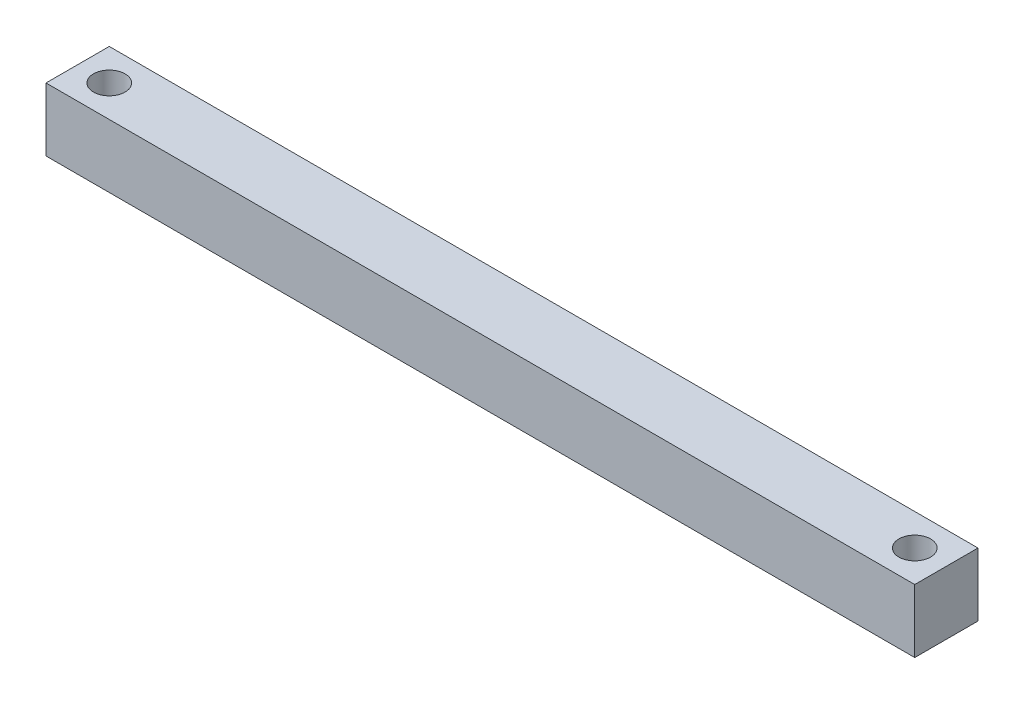
ISO-10303-21;
HEADER;
FILE_DESCRIPTION(('STEP AP214'),'2;1');
FILE_NAME('part.step','',(''),(''),'','','');
FILE_SCHEMA(('AUTOMOTIVE_DESIGN { 1 0 10303 214 1 1 1 1 }'));
ENDSEC;
DATA;
#1=APPLICATION_CONTEXT('core data for automotive mechanical design processes');
#2=APPLICATION_PROTOCOL_DEFINITION('international standard','automotive_design',2000,#1);
#3=PRODUCT_CONTEXT('',#1,'mechanical');
#4=PRODUCT('Part','Part','',(#3));
#5=PRODUCT_RELATED_PRODUCT_CATEGORY('part','',(#4));
#6=PRODUCT_DEFINITION_FORMATION('','',#4);
#7=PRODUCT_DEFINITION_CONTEXT('part definition',#1,'design');
#8=PRODUCT_DEFINITION('design','',#6,#7);
#9=PRODUCT_DEFINITION_SHAPE('','',#8);
#10=(LENGTH_UNIT() NAMED_UNIT(*) SI_UNIT(.MILLI.,.METRE.));
#11=(NAMED_UNIT(*) PLANE_ANGLE_UNIT() SI_UNIT($,.RADIAN.));
#12=(NAMED_UNIT(*) SI_UNIT($,.STERADIAN.) SOLID_ANGLE_UNIT());
#13=UNCERTAINTY_MEASURE_WITH_UNIT(LENGTH_MEASURE(1.E-05),#10,'distance_accuracy_value','');
#14=(GEOMETRIC_REPRESENTATION_CONTEXT(3) GLOBAL_UNCERTAINTY_ASSIGNED_CONTEXT((#13)) GLOBAL_UNIT_ASSIGNED_CONTEXT((#10,
#11,#12)) REPRESENTATION_CONTEXT('',''));
#15=CARTESIAN_POINT('',(0.,0.,0.));
#16=DIRECTION('',(0.,0.,1.));
#17=DIRECTION('',(1.,0.,0.));
#18=AXIS2_PLACEMENT_3D('',#15,#16,#17);
#19=CARTESIAN_POINT('',(-348.829051578262,-12.7,-12.7));
#20=DIRECTION('',(0.,0.,-1.));
#21=DIRECTION('',(-1.,0.,0.));
#22=AXIS2_PLACEMENT_3D('',#19,#20,#21);
#23=PLANE('',#22);
#24=DIRECTION('',(0.,1.,0.));
#25=VECTOR('',#24,1.);
#26=CARTESIAN_POINT('',(0.,-12.7,-12.7));
#27=LINE('',#26,#25);
#28=CARTESIAN_POINT('',(0.,-12.7,-12.7));
#29=VERTEX_POINT('',#28);
#30=CARTESIAN_POINT('',(0.,12.7,-12.7));
#31=VERTEX_POINT('',#30);
#32=EDGE_CURVE('E110',#29,#31,#27,.T.);
#33=ORIENTED_EDGE('',*,*,#32,.F.);
#34=DIRECTION('',(1.,0.,0.));
#35=VECTOR('',#34,1.);
#36=CARTESIAN_POINT('',(-348.829051578262,-12.7,-12.7));
#37=LINE('',#36,#35);
#38=CARTESIAN_POINT('',(-348.829051578262,-12.7,-12.7));
#39=VERTEX_POINT('',#38);
#40=EDGE_CURVE('E11',#39,#29,#37,.T.);
#41=ORIENTED_EDGE('',*,*,#40,.F.);
#42=DIRECTION('',(0.,1.,0.));
#43=VECTOR('',#42,1.);
#44=CARTESIAN_POINT('',(-348.829051578262,-12.7,-12.7));
#45=LINE('',#44,#43);
#46=CARTESIAN_POINT('',(-348.829051578262,12.7,-12.7));
#47=VERTEX_POINT('',#46);
#48=EDGE_CURVE('E101',#39,#47,#45,.T.);
#49=ORIENTED_EDGE('',*,*,#48,.T.);
#50=DIRECTION('',(1.,0.,0.));
#51=VECTOR('',#50,1.);
#52=CARTESIAN_POINT('',(-348.829051578262,12.7,-12.7));
#53=LINE('',#52,#51);
#54=EDGE_CURVE('E42',#47,#31,#53,.T.);
#55=ORIENTED_EDGE('',*,*,#54,.T.);
#56=EDGE_LOOP('',(#33,#41,#49,#55));
#57=FACE_BOUND('',#56,.T.);
#58=ADVANCED_FACE('F39',(#57),#23,.T.);
#59=CARTESIAN_POINT('',(-348.829051578262,-12.7,12.7));
#60=DIRECTION('',(0.,-1.,0.));
#61=DIRECTION('',(0.,0.,-1.));
#62=AXIS2_PLACEMENT_3D('',#59,#60,#61);
#63=PLANE('',#62);
#64=CARTESIAN_POINT('',(-336.129051578262,-12.7,0.));
#65=DIRECTION('',(0.,1.,0.));
#66=DIRECTION('',(0.,0.,1.));
#67=AXIS2_PLACEMENT_3D('',#64,#65,#66);
#68=CIRCLE('',#67,6.35);
#69=CARTESIAN_POINT('',(-336.129051578262,-12.7,6.35));
#70=VERTEX_POINT('',#69);
#71=EDGE_CURVE('E115',#70,#70,#68,.T.);
#72=ORIENTED_EDGE('',*,*,#71,.T.);
#73=EDGE_LOOP('',(#72));
#74=FACE_BOUND('',#73,.T.);
#75=CARTESIAN_POINT('',(-12.7,-12.7,0.));
#76=DIRECTION('',(0.,1.,0.));
#77=DIRECTION('',(0.,0.,-1.));
#78=AXIS2_PLACEMENT_3D('',#75,#76,#77);
#79=CIRCLE('',#78,6.35);
#80=CARTESIAN_POINT('',(-12.7,-12.7,-6.35));
#81=VERTEX_POINT('',#80);
#82=EDGE_CURVE('E154',#81,#81,#79,.T.);
#83=ORIENTED_EDGE('',*,*,#82,.T.);
#84=EDGE_LOOP('',(#83));
#85=FACE_BOUND('',#84,.T.);
#86=DIRECTION('',(0.,0.,-1.));
#87=VECTOR('',#86,1.);
#88=CARTESIAN_POINT('',(0.,-12.7,12.7));
#89=LINE('',#88,#87);
#90=CARTESIAN_POINT('',(0.,-12.7,12.7));
#91=VERTEX_POINT('',#90);
#92=EDGE_CURVE('E104',#91,#29,#89,.T.);
#93=ORIENTED_EDGE('',*,*,#92,.F.);
#94=DIRECTION('',(1.,0.,0.));
#95=VECTOR('',#94,1.);
#96=CARTESIAN_POINT('',(-348.829051578262,-12.7,12.7));
#97=LINE('',#96,#95);
#98=CARTESIAN_POINT('',(-348.829051578262,-12.7,12.7));
#99=VERTEX_POINT('',#98);
#100=EDGE_CURVE('E49',#99,#91,#97,.T.);
#101=ORIENTED_EDGE('',*,*,#100,.F.);
#102=DIRECTION('',(0.,0.,-1.));
#103=VECTOR('',#102,1.);
#104=CARTESIAN_POINT('',(-348.829051578262,-12.7,12.7));
#105=LINE('',#104,#103);
#106=EDGE_CURVE('E96',#99,#39,#105,.T.);
#107=ORIENTED_EDGE('',*,*,#106,.T.);
#108=ORIENTED_EDGE('',*,*,#40,.T.);
#109=EDGE_LOOP('',(#93,#101,#107,#108));
#110=FACE_BOUND('',#109,.T.);
#111=ADVANCED_FACE('F127',(#74,#85,#110),#63,.T.);
#112=CARTESIAN_POINT('',(-348.829051578262,-12.7,12.7));
#113=DIRECTION('',(0.,0.,1.));
#114=DIRECTION('',(1.,0.,0.));
#115=AXIS2_PLACEMENT_3D('',#112,#113,#114);
#116=PLANE('',#115);
#117=DIRECTION('',(0.,-1.,0.));
#118=VECTOR('',#117,1.);
#119=CARTESIAN_POINT('',(0.,-12.7,12.7));
#120=LINE('',#119,#118);
#121=CARTESIAN_POINT('',(0.,12.7,12.7));
#122=VERTEX_POINT('',#121);
#123=EDGE_CURVE('E90',#122,#91,#120,.T.);
#124=ORIENTED_EDGE('',*,*,#123,.F.);
#125=DIRECTION('',(1.,0.,0.));
#126=VECTOR('',#125,1.);
#127=CARTESIAN_POINT('',(-348.829051578262,12.7,12.7));
#128=LINE('',#127,#126);
#129=CARTESIAN_POINT('',(-348.829051578262,12.7,12.7));
#130=VERTEX_POINT('',#129);
#131=EDGE_CURVE('E85',#130,#122,#128,.T.);
#132=ORIENTED_EDGE('',*,*,#131,.F.);
#133=DIRECTION('',(0.,-1.,0.));
#134=VECTOR('',#133,1.);
#135=CARTESIAN_POINT('',(-348.829051578262,-12.7,12.7));
#136=LINE('',#135,#134);
#137=EDGE_CURVE('E88',#130,#99,#136,.T.);
#138=ORIENTED_EDGE('',*,*,#137,.T.);
#139=ORIENTED_EDGE('',*,*,#100,.T.);
#140=EDGE_LOOP('',(#124,#132,#138,#139));
#141=FACE_BOUND('',#140,.T.);
#142=ADVANCED_FACE('F87',(#141),#116,.T.);
#143=CARTESIAN_POINT('',(-348.829051578262,12.7,12.7));
#144=DIRECTION('',(0.,1.,0.));
#145=DIRECTION('',(0.,0.,1.));
#146=AXIS2_PLACEMENT_3D('',#143,#144,#145);
#147=PLANE('',#146);
#148=CARTESIAN_POINT('',(-336.129051578262,12.7,0.));
#149=DIRECTION('',(0.,1.,0.));
#150=DIRECTION('',(0.,0.,1.));
#151=AXIS2_PLACEMENT_3D('',#148,#149,#150);
#152=CIRCLE('',#151,6.35);
#153=CARTESIAN_POINT('',(-336.129051578262,12.7,6.35));
#154=VERTEX_POINT('',#153);
#155=EDGE_CURVE('E148',#154,#154,#152,.T.);
#156=ORIENTED_EDGE('',*,*,#155,.F.);
#157=EDGE_LOOP('',(#156));
#158=FACE_BOUND('',#157,.T.);
#159=CARTESIAN_POINT('',(-12.7,12.7,0.));
#160=DIRECTION('',(0.,1.,0.));
#161=DIRECTION('',(0.,0.,-1.));
#162=AXIS2_PLACEMENT_3D('',#159,#160,#161);
#163=CIRCLE('',#162,6.35);
#164=CARTESIAN_POINT('',(-12.7,12.7,-6.35));
#165=VERTEX_POINT('',#164);
#166=EDGE_CURVE('E151',#165,#165,#163,.T.);
#167=ORIENTED_EDGE('',*,*,#166,.F.);
#168=EDGE_LOOP('',(#167));
#169=FACE_BOUND('',#168,.T.);
#170=DIRECTION('',(0.,0.,1.));
#171=VECTOR('',#170,1.);
#172=CARTESIAN_POINT('',(0.,12.7,12.7));
#173=LINE('',#172,#171);
#174=EDGE_CURVE('E114',#31,#122,#173,.T.);
#175=ORIENTED_EDGE('',*,*,#174,.F.);
#176=ORIENTED_EDGE('',*,*,#54,.F.);
#177=DIRECTION('',(0.,0.,1.));
#178=VECTOR('',#177,1.);
#179=CARTESIAN_POINT('',(-348.829051578262,12.7,12.7));
#180=LINE('',#179,#178);
#181=EDGE_CURVE('E95',#47,#130,#180,.T.);
#182=ORIENTED_EDGE('',*,*,#181,.T.);
#183=ORIENTED_EDGE('',*,*,#131,.T.);
#184=EDGE_LOOP('',(#175,#176,#182,#183));
#185=FACE_BOUND('',#184,.T.);
#186=ADVANCED_FACE('F99',(#158,#169,#185),#147,.T.);
#187=CARTESIAN_POINT('',(-348.829051578262,0.,0.));
#188=DIRECTION('',(-1.,0.,0.));
#189=DIRECTION('',(0.,0.,1.));
#190=AXIS2_PLACEMENT_3D('',#187,#188,#189);
#191=PLANE('',#190);
#192=ORIENTED_EDGE('',*,*,#48,.F.);
#193=ORIENTED_EDGE('',*,*,#106,.F.);
#194=ORIENTED_EDGE('',*,*,#137,.F.);
#195=ORIENTED_EDGE('',*,*,#181,.F.);
#196=EDGE_LOOP('',(#192,#193,#194,#195));
#197=FACE_BOUND('',#196,.T.);
#198=ADVANCED_FACE('F94',(#197),#191,.T.);
#199=CARTESIAN_POINT('',(0.,0.,0.));
#200=DIRECTION('',(-1.,0.,0.));
#201=DIRECTION('',(0.,0.,1.));
#202=AXIS2_PLACEMENT_3D('',#199,#200,#201);
#203=PLANE('',#202);
#204=ORIENTED_EDGE('',*,*,#32,.T.);
#205=ORIENTED_EDGE('',*,*,#174,.T.);
#206=ORIENTED_EDGE('',*,*,#123,.T.);
#207=ORIENTED_EDGE('',*,*,#92,.T.);
#208=EDGE_LOOP('',(#204,#205,#206,#207));
#209=FACE_BOUND('',#208,.T.);
#210=ADVANCED_FACE('F126',(#209),#203,.F.);
#211=CARTESIAN_POINT('',(-12.7,-12.7,0.));
#212=DIRECTION('',(0.,1.,0.));
#213=DIRECTION('',(0.,0.,1.));
#214=AXIS2_PLACEMENT_3D('',#211,#212,#213);
#215=CYLINDRICAL_SURFACE('',#214,6.35);
#216=ORIENTED_EDGE('',*,*,#82,.F.);
#217=EDGE_LOOP('',(#216));
#218=FACE_BOUND('',#217,.T.);
#219=ORIENTED_EDGE('',*,*,#166,.T.);
#220=EDGE_LOOP('',(#219));
#221=FACE_BOUND('',#220,.T.);
#222=ADVANCED_FACE('F167',(#218,#221),#215,.F.);
#223=CARTESIAN_POINT('',(-336.129051578262,-12.7,0.));
#224=DIRECTION('',(0.,1.,0.));
#225=DIRECTION('',(0.,0.,1.));
#226=AXIS2_PLACEMENT_3D('',#223,#224,#225);
#227=CYLINDRICAL_SURFACE('',#226,6.35);
#228=ORIENTED_EDGE('',*,*,#71,.F.);
#229=EDGE_LOOP('',(#228));
#230=FACE_BOUND('',#229,.T.);
#231=ORIENTED_EDGE('',*,*,#155,.T.);
#232=EDGE_LOOP('',(#231));
#233=FACE_BOUND('',#232,.T.);
#234=ADVANCED_FACE('F164',(#230,#233),#227,.F.);
#235=CLOSED_SHELL('',(#58,#111,#142,#186,#198,#210,#222,#234));
#236=MANIFOLD_SOLID_BREP('B2',#235);
#237=ADVANCED_BREP_SHAPE_REPRESENTATION('',(#18,#236),#14);
#238=SHAPE_DEFINITION_REPRESENTATION(#9,#237);
ENDSEC;
END-ISO-10303-21;
